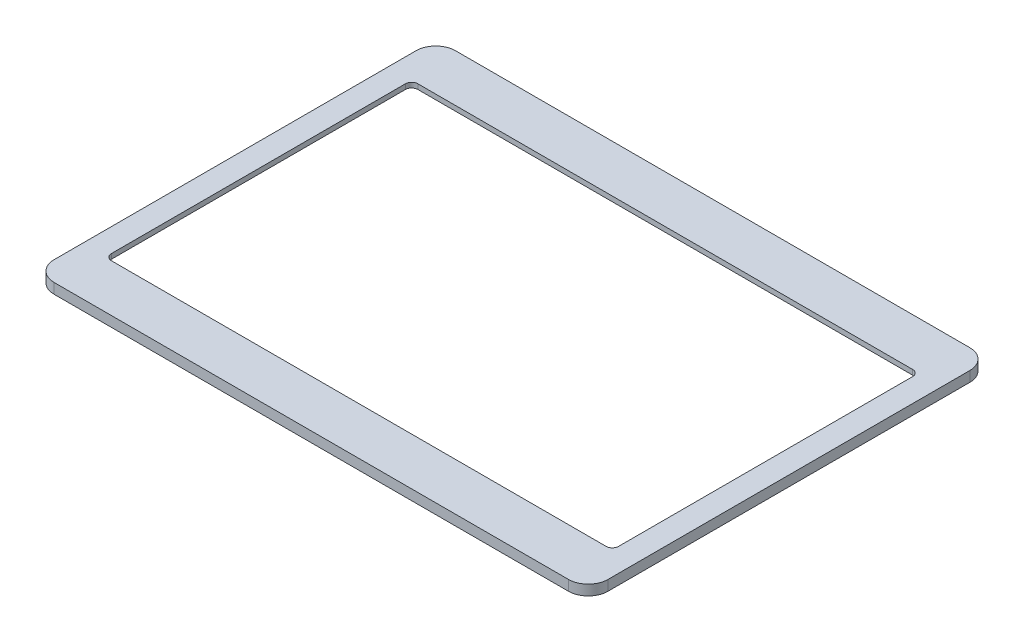
ISO-10303-21;
HEADER;
FILE_DESCRIPTION(('STEP AP214'),'2;1');
FILE_NAME('part.step','',(''),(''),'','','');
FILE_SCHEMA(('AUTOMOTIVE_DESIGN { 1 0 10303 214 1 1 1 1 }'));
ENDSEC;
DATA;
#1=APPLICATION_CONTEXT('core data for automotive mechanical design processes');
#2=APPLICATION_PROTOCOL_DEFINITION('international standard','automotive_design',2000,#1);
#3=PRODUCT_CONTEXT('',#1,'mechanical');
#4=PRODUCT('Part','Part','',(#3));
#5=PRODUCT_RELATED_PRODUCT_CATEGORY('part','',(#4));
#6=PRODUCT_DEFINITION_FORMATION('','',#4);
#7=PRODUCT_DEFINITION_CONTEXT('part definition',#1,'design');
#8=PRODUCT_DEFINITION('design','',#6,#7);
#9=PRODUCT_DEFINITION_SHAPE('','',#8);
#10=(LENGTH_UNIT() NAMED_UNIT(*) SI_UNIT(.MILLI.,.METRE.));
#11=(NAMED_UNIT(*) PLANE_ANGLE_UNIT() SI_UNIT($,.RADIAN.));
#12=(NAMED_UNIT(*) SI_UNIT($,.STERADIAN.) SOLID_ANGLE_UNIT());
#13=UNCERTAINTY_MEASURE_WITH_UNIT(LENGTH_MEASURE(1.E-05),#10,'distance_accuracy_value','');
#14=(GEOMETRIC_REPRESENTATION_CONTEXT(3) GLOBAL_UNCERTAINTY_ASSIGNED_CONTEXT((#13)) GLOBAL_UNIT_ASSIGNED_CONTEXT((#10,
#11,#12)) REPRESENTATION_CONTEXT('',''));
#15=CARTESIAN_POINT('',(0.,0.,0.));
#16=DIRECTION('',(0.,0.,1.));
#17=DIRECTION('',(1.,0.,0.));
#18=AXIS2_PLACEMENT_3D('',#15,#16,#17);
#19=CARTESIAN_POINT('',(-82.65,0.,-58.15));
#20=DIRECTION('',(0.,-1.,0.));
#21=DIRECTION('',(0.,0.,-1.));
#22=AXIS2_PLACEMENT_3D('',#19,#20,#21);
#23=PLANE('',#22);
#24=CARTESIAN_POINT('',(-82.65,0.,-58.15));
#25=DIRECTION('',(0.,1.,0.));
#26=DIRECTION('',(0.,0.,-1.));
#27=AXIS2_PLACEMENT_3D('',#24,#25,#26);
#28=CIRCLE('',#27,6.35);
#29=CARTESIAN_POINT('',(-82.65,0.,-64.5));
#30=VERTEX_POINT('',#29);
#31=CARTESIAN_POINT('',(-89.,0.,-58.15));
#32=VERTEX_POINT('',#31);
#33=EDGE_CURVE('E279',#30,#32,#28,.T.);
#34=ORIENTED_EDGE('',*,*,#33,.F.);
#35=DIRECTION('',(-1.,0.,0.));
#36=VECTOR('',#35,1.);
#37=CARTESIAN_POINT('',(-82.65,0.,-64.5));
#38=LINE('',#37,#36);
#39=CARTESIAN_POINT('',(82.65,0.,-64.5));
#40=VERTEX_POINT('',#39);
#41=EDGE_CURVE('E284',#40,#30,#38,.T.);
#42=ORIENTED_EDGE('',*,*,#41,.F.);
#43=CARTESIAN_POINT('',(82.65,0.,-58.15));
#44=DIRECTION('',(0.,1.,0.));
#45=DIRECTION('',(0.,0.,1.));
#46=AXIS2_PLACEMENT_3D('',#43,#44,#45);
#47=CIRCLE('',#46,6.35);
#48=CARTESIAN_POINT('',(89.,0.,-58.15));
#49=VERTEX_POINT('',#48);
#50=EDGE_CURVE('E311',#49,#40,#47,.T.);
#51=ORIENTED_EDGE('',*,*,#50,.F.);
#52=DIRECTION('',(0.,0.,-1.));
#53=VECTOR('',#52,1.);
#54=CARTESIAN_POINT('',(89.,0.,-58.15));
#55=LINE('',#54,#53);
#56=CARTESIAN_POINT('',(89.0000000000001,0.,58.15));
#57=VERTEX_POINT('',#56);
#58=EDGE_CURVE('E309',#57,#49,#55,.T.);
#59=ORIENTED_EDGE('',*,*,#58,.F.);
#60=CARTESIAN_POINT('',(82.6500000000001,0.,58.15));
#61=DIRECTION('',(0.,1.,0.));
#62=DIRECTION('',(0.,0.,1.));
#63=AXIS2_PLACEMENT_3D('',#60,#61,#62);
#64=CIRCLE('',#63,6.34999999999998);
#65=CARTESIAN_POINT('',(82.6500000000001,0.,64.5));
#66=VERTEX_POINT('',#65);
#67=EDGE_CURVE('E307',#66,#57,#64,.T.);
#68=ORIENTED_EDGE('',*,*,#67,.F.);
#69=DIRECTION('',(1.,0.,0.));
#70=VECTOR('',#69,1.);
#71=CARTESIAN_POINT('',(-82.65,0.,64.5));
#72=LINE('',#71,#70);
#73=CARTESIAN_POINT('',(-82.65,0.,64.5));
#74=VERTEX_POINT('',#73);
#75=EDGE_CURVE('E305',#74,#66,#72,.T.);
#76=ORIENTED_EDGE('',*,*,#75,.F.);
#77=CARTESIAN_POINT('',(-82.65,0.,58.15));
#78=DIRECTION('',(0.,1.,0.));
#79=DIRECTION('',(0.,0.,1.));
#80=AXIS2_PLACEMENT_3D('',#77,#78,#79);
#81=CIRCLE('',#80,6.34999999999999);
#82=CARTESIAN_POINT('',(-88.9999999999999,0.,58.15));
#83=VERTEX_POINT('',#82);
#84=EDGE_CURVE('E303',#83,#74,#81,.T.);
#85=ORIENTED_EDGE('',*,*,#84,.F.);
#86=DIRECTION('',(0.,0.,1.));
#87=VECTOR('',#86,1.);
#88=CARTESIAN_POINT('',(-89.,0.,-58.15));
#89=LINE('',#88,#87);
#90=EDGE_CURVE('E301',#32,#83,#89,.T.);
#91=ORIENTED_EDGE('',*,*,#90,.F.);
#92=EDGE_LOOP('',(#34,#42,#51,#59,#68,#76,#85,#91));
#93=FACE_BOUND('',#92,.T.);
#94=DIRECTION('',(0.,0.,-1.));
#95=VECTOR('',#94,1.);
#96=CARTESIAN_POINT('',(15.5,0.,60.5));
#97=LINE('',#96,#95);
#98=CARTESIAN_POINT('',(15.5,0.,60.5));
#99=VERTEX_POINT('',#98);
#100=CARTESIAN_POINT('',(15.5,0.,58.75));
#101=VERTEX_POINT('',#100);
#102=EDGE_CURVE('E208',#99,#101,#97,.T.);
#103=ORIENTED_EDGE('',*,*,#102,.T.);
#104=DIRECTION('',(1.,0.,0.));
#105=VECTOR('',#104,1.);
#106=CARTESIAN_POINT('',(15.5,0.,58.75));
#107=LINE('',#106,#105);
#108=CARTESIAN_POINT('',(85.5,0.,58.75));
#109=VERTEX_POINT('',#108);
#110=EDGE_CURVE('E47',#101,#109,#107,.T.);
#111=ORIENTED_EDGE('',*,*,#110,.T.);
#112=DIRECTION('',(0.,0.,-1.));
#113=VECTOR('',#112,1.);
#114=CARTESIAN_POINT('',(85.5,0.,-53.5));
#115=LINE('',#114,#113);
#116=CARTESIAN_POINT('',(85.5,0.,-53.5));
#117=VERTEX_POINT('',#116);
#118=EDGE_CURVE('E212',#109,#117,#115,.T.);
#119=ORIENTED_EDGE('',*,*,#118,.T.);
#120=DIRECTION('',(-1.,0.,0.));
#121=VECTOR('',#120,1.);
#122=CARTESIAN_POINT('',(-85.5,0.,-53.5));
#123=LINE('',#122,#121);
#124=CARTESIAN_POINT('',(-85.5,0.,-53.5));
#125=VERTEX_POINT('',#124);
#126=EDGE_CURVE('E663',#117,#125,#123,.T.);
#127=ORIENTED_EDGE('',*,*,#126,.T.);
#128=DIRECTION('',(0.,0.,1.));
#129=VECTOR('',#128,1.);
#130=CARTESIAN_POINT('',(-85.5,0.,-53.5));
#131=LINE('',#130,#129);
#132=CARTESIAN_POINT('',(-85.5,0.,58.5));
#133=VERTEX_POINT('',#132);
#134=EDGE_CURVE('E665',#125,#133,#131,.T.);
#135=ORIENTED_EDGE('',*,*,#134,.T.);
#136=DIRECTION('',(1.,0.,0.));
#137=VECTOR('',#136,1.);
#138=CARTESIAN_POINT('',(-85.5,0.,58.5));
#139=LINE('',#138,#137);
#140=CARTESIAN_POINT('',(-15.5,0.,58.5));
#141=VERTEX_POINT('',#140);
#142=EDGE_CURVE('E647',#133,#141,#139,.T.);
#143=ORIENTED_EDGE('',*,*,#142,.T.);
#144=DIRECTION('',(0.,0.,1.));
#145=VECTOR('',#144,1.);
#146=CARTESIAN_POINT('',(-15.5,0.,58.5));
#147=LINE('',#146,#145);
#148=CARTESIAN_POINT('',(-15.5,0.,60.5));
#149=VERTEX_POINT('',#148);
#150=EDGE_CURVE('E644',#141,#149,#147,.T.);
#151=ORIENTED_EDGE('',*,*,#150,.T.);
#152=DIRECTION('',(1.,0.,0.));
#153=VECTOR('',#152,1.);
#154=CARTESIAN_POINT('',(-15.5,0.,60.5));
#155=LINE('',#154,#153);
#156=EDGE_CURVE('E638',#149,#99,#155,.T.);
#157=ORIENTED_EDGE('',*,*,#156,.T.);
#158=EDGE_LOOP('',(#103,#111,#119,#127,#135,#143,#151,#157));
#159=FACE_BOUND('',#158,.T.);
#160=ADVANCED_FACE('F32',(#93,#159),#23,.T.);
#161=CARTESIAN_POINT('',(-79.5,3.3,-47.25));
#162=DIRECTION('',(0.,-1.,0.));
#163=DIRECTION('',(0.,0.,-1.));
#164=AXIS2_PLACEMENT_3D('',#161,#162,#163);
#165=CYLINDRICAL_SURFACE('',#164,2.);
#166=DIRECTION('',(0.,-1.,0.));
#167=VECTOR('',#166,1.);
#168=CARTESIAN_POINT('',(-81.5,3.3,-47.25));
#169=LINE('',#168,#167);
#170=CARTESIAN_POINT('',(-81.5,3.3,-47.25));
#171=VERTEX_POINT('',#170);
#172=CARTESIAN_POINT('',(-81.5,1.7,-47.25));
#173=VERTEX_POINT('',#172);
#174=EDGE_CURVE('E276',#171,#173,#169,.T.);
#175=ORIENTED_EDGE('',*,*,#174,.T.);
#176=CARTESIAN_POINT('',(-79.5,1.7,-47.25));
#177=DIRECTION('',(0.,-1.,0.));
#178=DIRECTION('',(0.,0.,-1.));
#179=AXIS2_PLACEMENT_3D('',#176,#177,#178);
#180=CIRCLE('',#179,2.);
#181=CARTESIAN_POINT('',(-79.5,1.7,-49.25));
#182=VERTEX_POINT('',#181);
#183=EDGE_CURVE('E235',#173,#182,#180,.T.);
#184=ORIENTED_EDGE('',*,*,#183,.T.);
#185=DIRECTION('',(0.,-1.,0.));
#186=VECTOR('',#185,1.);
#187=CARTESIAN_POINT('',(-79.5,3.3,-49.25));
#188=LINE('',#187,#186);
#189=CARTESIAN_POINT('',(-79.5,3.3,-49.25));
#190=VERTEX_POINT('',#189);
#191=EDGE_CURVE('E255',#190,#182,#188,.T.);
#192=ORIENTED_EDGE('',*,*,#191,.F.);
#193=CARTESIAN_POINT('',(-79.5,3.3,-47.25));
#194=DIRECTION('',(0.,1.,0.));
#195=DIRECTION('',(0.,0.,1.));
#196=AXIS2_PLACEMENT_3D('',#193,#194,#195);
#197=CIRCLE('',#196,2.);
#198=EDGE_CURVE('E238',#190,#171,#197,.T.);
#199=ORIENTED_EDGE('',*,*,#198,.T.);
#200=EDGE_LOOP('',(#175,#184,#192,#199));
#201=FACE_BOUND('',#200,.T.);
#202=ADVANCED_FACE('F385',(#201),#165,.F.);
#203=CARTESIAN_POINT('',(-81.5,3.3,-47.25));
#204=DIRECTION('',(1.,0.,0.));
#205=DIRECTION('',(0.,0.,-1.));
#206=AXIS2_PLACEMENT_3D('',#203,#204,#205);
#207=PLANE('',#206);
#208=DIRECTION('',(0.,-1.,0.));
#209=VECTOR('',#208,1.);
#210=CARTESIAN_POINT('',(-81.5,3.3,47.25));
#211=LINE('',#210,#209);
#212=CARTESIAN_POINT('',(-81.5,3.3,47.25));
#213=VERTEX_POINT('',#212);
#214=CARTESIAN_POINT('',(-81.5,1.7,47.25));
#215=VERTEX_POINT('',#214);
#216=EDGE_CURVE('E273',#213,#215,#211,.T.);
#217=ORIENTED_EDGE('',*,*,#216,.T.);
#218=DIRECTION('',(0.,0.,-1.));
#219=VECTOR('',#218,1.);
#220=CARTESIAN_POINT('',(-81.5,1.7,-47.25));
#221=LINE('',#220,#219);
#222=EDGE_CURVE('E232',#215,#173,#221,.T.);
#223=ORIENTED_EDGE('',*,*,#222,.T.);
#224=ORIENTED_EDGE('',*,*,#174,.F.);
#225=DIRECTION('',(0.,0.,1.));
#226=VECTOR('',#225,1.);
#227=CARTESIAN_POINT('',(-81.5,3.3,-47.25));
#228=LINE('',#227,#226);
#229=EDGE_CURVE('E240',#171,#213,#228,.T.);
#230=ORIENTED_EDGE('',*,*,#229,.T.);
#231=EDGE_LOOP('',(#217,#223,#224,#230));
#232=FACE_BOUND('',#231,.T.);
#233=ADVANCED_FACE('F390',(#232),#207,.T.);
#234=CARTESIAN_POINT('',(-79.5,3.3,47.25));
#235=DIRECTION('',(0.,-1.,0.));
#236=DIRECTION('',(0.,0.,-1.));
#237=AXIS2_PLACEMENT_3D('',#234,#235,#236);
#238=CYLINDRICAL_SURFACE('',#237,2.);
#239=DIRECTION('',(0.,-1.,0.));
#240=VECTOR('',#239,1.);
#241=CARTESIAN_POINT('',(-79.5,3.3,49.25));
#242=LINE('',#241,#240);
#243=CARTESIAN_POINT('',(-79.5,3.3,49.25));
#244=VERTEX_POINT('',#243);
#245=CARTESIAN_POINT('',(-79.5,1.7,49.25));
#246=VERTEX_POINT('',#245);
#247=EDGE_CURVE('E270',#244,#246,#242,.T.);
#248=ORIENTED_EDGE('',*,*,#247,.T.);
#249=CARTESIAN_POINT('',(-79.5,1.7,47.25));
#250=DIRECTION('',(0.,-1.,0.));
#251=DIRECTION('',(0.,0.,-1.));
#252=AXIS2_PLACEMENT_3D('',#249,#250,#251);
#253=CIRCLE('',#252,2.);
#254=EDGE_CURVE('E229',#246,#215,#253,.T.);
#255=ORIENTED_EDGE('',*,*,#254,.T.);
#256=ORIENTED_EDGE('',*,*,#216,.F.);
#257=CARTESIAN_POINT('',(-79.5,3.3,47.25));
#258=DIRECTION('',(0.,1.,0.));
#259=DIRECTION('',(0.,0.,-1.));
#260=AXIS2_PLACEMENT_3D('',#257,#258,#259);
#261=CIRCLE('',#260,2.);
#262=EDGE_CURVE('E242',#213,#244,#261,.T.);
#263=ORIENTED_EDGE('',*,*,#262,.T.);
#264=EDGE_LOOP('',(#248,#255,#256,#263));
#265=FACE_BOUND('',#264,.T.);
#266=ADVANCED_FACE('F508',(#265),#238,.F.);
#267=CARTESIAN_POINT('',(-79.5,3.3,49.25));
#268=DIRECTION('',(0.,0.,-1.));
#269=DIRECTION('',(-1.,0.,0.));
#270=AXIS2_PLACEMENT_3D('',#267,#268,#269);
#271=PLANE('',#270);
#272=DIRECTION('',(0.,-1.,0.));
#273=VECTOR('',#272,1.);
#274=CARTESIAN_POINT('',(79.5,3.3,49.25));
#275=LINE('',#274,#273);
#276=CARTESIAN_POINT('',(79.5,3.3,49.25));
#277=VERTEX_POINT('',#276);
#278=CARTESIAN_POINT('',(79.5,1.7,49.25));
#279=VERTEX_POINT('',#278);
#280=EDGE_CURVE('E267',#277,#279,#275,.T.);
#281=ORIENTED_EDGE('',*,*,#280,.T.);
#282=DIRECTION('',(-1.,0.,0.));
#283=VECTOR('',#282,1.);
#284=CARTESIAN_POINT('',(-79.5,1.7,49.25));
#285=LINE('',#284,#283);
#286=EDGE_CURVE('E226',#279,#246,#285,.T.);
#287=ORIENTED_EDGE('',*,*,#286,.T.);
#288=ORIENTED_EDGE('',*,*,#247,.F.);
#289=DIRECTION('',(1.,0.,0.));
#290=VECTOR('',#289,1.);
#291=CARTESIAN_POINT('',(-79.5,3.3,49.25));
#292=LINE('',#291,#290);
#293=EDGE_CURVE('E244',#244,#277,#292,.T.);
#294=ORIENTED_EDGE('',*,*,#293,.T.);
#295=EDGE_LOOP('',(#281,#287,#288,#294));
#296=FACE_BOUND('',#295,.T.);
#297=ADVANCED_FACE('F517',(#296),#271,.T.);
#298=CARTESIAN_POINT('',(79.5,3.3,47.25));
#299=DIRECTION('',(0.,-1.,0.));
#300=DIRECTION('',(0.,0.,-1.));
#301=AXIS2_PLACEMENT_3D('',#298,#299,#300);
#302=CYLINDRICAL_SURFACE('',#301,2.00000000000001);
#303=DIRECTION('',(0.,-1.,0.));
#304=VECTOR('',#303,1.);
#305=CARTESIAN_POINT('',(81.5,3.3,47.25));
#306=LINE('',#305,#304);
#307=CARTESIAN_POINT('',(81.5,3.3,47.25));
#308=VERTEX_POINT('',#307);
#309=CARTESIAN_POINT('',(81.5,1.7,47.25));
#310=VERTEX_POINT('',#309);
#311=EDGE_CURVE('E264',#308,#310,#306,.T.);
#312=ORIENTED_EDGE('',*,*,#311,.T.);
#313=CARTESIAN_POINT('',(79.5,1.7,47.25));
#314=DIRECTION('',(0.,-1.,0.));
#315=DIRECTION('',(0.,0.,-1.));
#316=AXIS2_PLACEMENT_3D('',#313,#314,#315);
#317=CIRCLE('',#316,2.00000000000001);
#318=EDGE_CURVE('E223',#310,#279,#317,.T.);
#319=ORIENTED_EDGE('',*,*,#318,.T.);
#320=ORIENTED_EDGE('',*,*,#280,.F.);
#321=CARTESIAN_POINT('',(79.5,3.3,47.25));
#322=DIRECTION('',(0.,1.,0.));
#323=DIRECTION('',(0.,0.,1.));
#324=AXIS2_PLACEMENT_3D('',#321,#322,#323);
#325=CIRCLE('',#324,2.00000000000001);
#326=EDGE_CURVE('E246',#277,#308,#325,.T.);
#327=ORIENTED_EDGE('',*,*,#326,.T.);
#328=EDGE_LOOP('',(#312,#319,#320,#327));
#329=FACE_BOUND('',#328,.T.);
#330=ADVANCED_FACE('F526',(#329),#302,.F.);
#331=CARTESIAN_POINT('',(81.5,3.3,-47.25));
#332=DIRECTION('',(-1.,0.,0.));
#333=DIRECTION('',(0.,0.,1.));
#334=AXIS2_PLACEMENT_3D('',#331,#332,#333);
#335=PLANE('',#334);
#336=DIRECTION('',(0.,-1.,0.));
#337=VECTOR('',#336,1.);
#338=CARTESIAN_POINT('',(81.5,3.3,-47.25));
#339=LINE('',#338,#337);
#340=CARTESIAN_POINT('',(81.5,3.3,-47.25));
#341=VERTEX_POINT('',#340);
#342=CARTESIAN_POINT('',(81.5,1.7,-47.25));
#343=VERTEX_POINT('',#342);
#344=EDGE_CURVE('E261',#341,#343,#339,.T.);
#345=ORIENTED_EDGE('',*,*,#344,.T.);
#346=DIRECTION('',(0.,0.,1.));
#347=VECTOR('',#346,1.);
#348=CARTESIAN_POINT('',(81.5,1.7,-47.25));
#349=LINE('',#348,#347);
#350=EDGE_CURVE('E215',#343,#310,#349,.T.);
#351=ORIENTED_EDGE('',*,*,#350,.T.);
#352=ORIENTED_EDGE('',*,*,#311,.F.);
#353=DIRECTION('',(0.,0.,-1.));
#354=VECTOR('',#353,1.);
#355=CARTESIAN_POINT('',(81.5,3.3,-47.25));
#356=LINE('',#355,#354);
#357=EDGE_CURVE('E248',#308,#341,#356,.T.);
#358=ORIENTED_EDGE('',*,*,#357,.T.);
#359=EDGE_LOOP('',(#345,#351,#352,#358));
#360=FACE_BOUND('',#359,.T.);
#361=ADVANCED_FACE('F535',(#360),#335,.T.);
#362=CARTESIAN_POINT('',(79.5,3.3,-47.25));
#363=DIRECTION('',(0.,-1.,0.));
#364=DIRECTION('',(0.,0.,-1.));
#365=AXIS2_PLACEMENT_3D('',#362,#363,#364);
#366=CYLINDRICAL_SURFACE('',#365,2.00000000000001);
#367=DIRECTION('',(0.,-1.,0.));
#368=VECTOR('',#367,1.);
#369=CARTESIAN_POINT('',(79.5,3.3,-49.25));
#370=LINE('',#369,#368);
#371=CARTESIAN_POINT('',(79.5,3.3,-49.25));
#372=VERTEX_POINT('',#371);
#373=CARTESIAN_POINT('',(79.5,1.7,-49.25));
#374=VERTEX_POINT('',#373);
#375=EDGE_CURVE('E258',#372,#374,#370,.T.);
#376=ORIENTED_EDGE('',*,*,#375,.T.);
#377=CARTESIAN_POINT('',(79.5,1.7,-47.25));
#378=DIRECTION('',(0.,-1.,0.));
#379=DIRECTION('',(0.,0.,-1.));
#380=AXIS2_PLACEMENT_3D('',#377,#378,#379);
#381=CIRCLE('',#380,2.00000000000001);
#382=EDGE_CURVE('E55',#374,#343,#381,.T.);
#383=ORIENTED_EDGE('',*,*,#382,.T.);
#384=ORIENTED_EDGE('',*,*,#344,.F.);
#385=CARTESIAN_POINT('',(79.5,3.3,-47.25));
#386=DIRECTION('',(0.,1.,0.));
#387=DIRECTION('',(0.,0.,1.));
#388=AXIS2_PLACEMENT_3D('',#385,#386,#387);
#389=CIRCLE('',#388,2.00000000000001);
#390=EDGE_CURVE('E250',#341,#372,#389,.T.);
#391=ORIENTED_EDGE('',*,*,#390,.T.);
#392=EDGE_LOOP('',(#376,#383,#384,#391));
#393=FACE_BOUND('',#392,.T.);
#394=ADVANCED_FACE('F544',(#393),#366,.F.);
#395=CARTESIAN_POINT('',(-79.5,3.3,-49.25));
#396=DIRECTION('',(0.,0.,1.));
#397=DIRECTION('',(1.,0.,0.));
#398=AXIS2_PLACEMENT_3D('',#395,#396,#397);
#399=PLANE('',#398);
#400=ORIENTED_EDGE('',*,*,#191,.T.);
#401=DIRECTION('',(1.,0.,0.));
#402=VECTOR('',#401,1.);
#403=CARTESIAN_POINT('',(-79.5,1.7,-49.25));
#404=LINE('',#403,#402);
#405=EDGE_CURVE('E11',#182,#374,#404,.T.);
#406=ORIENTED_EDGE('',*,*,#405,.T.);
#407=ORIENTED_EDGE('',*,*,#375,.F.);
#408=DIRECTION('',(-1.,0.,0.));
#409=VECTOR('',#408,1.);
#410=CARTESIAN_POINT('',(-79.5,3.3,-49.25));
#411=LINE('',#410,#409);
#412=EDGE_CURVE('E253',#372,#190,#411,.T.);
#413=ORIENTED_EDGE('',*,*,#412,.T.);
#414=EDGE_LOOP('',(#400,#406,#407,#413));
#415=FACE_BOUND('',#414,.T.);
#416=ADVANCED_FACE('F553',(#415),#399,.T.);
#417=CARTESIAN_POINT('',(-82.65,3.3,-58.15));
#418=DIRECTION('',(0.,-1.,0.));
#419=DIRECTION('',(0.,0.,-1.));
#420=AXIS2_PLACEMENT_3D('',#417,#418,#419);
#421=PLANE('',#420);
#422=CARTESIAN_POINT('',(-82.65,3.3,-58.15));
#423=DIRECTION('',(0.,1.,0.));
#424=DIRECTION('',(0.,0.,-1.));
#425=AXIS2_PLACEMENT_3D('',#422,#423,#424);
#426=CIRCLE('',#425,6.35);
#427=CARTESIAN_POINT('',(-82.65,3.3,-64.5));
#428=VERTEX_POINT('',#427);
#429=CARTESIAN_POINT('',(-89.,3.3,-58.15));
#430=VERTEX_POINT('',#429);
#431=EDGE_CURVE('E280',#428,#430,#426,.T.);
#432=ORIENTED_EDGE('',*,*,#431,.T.);
#433=DIRECTION('',(0.,0.,1.));
#434=VECTOR('',#433,1.);
#435=CARTESIAN_POINT('',(-89.,3.3,-58.15));
#436=LINE('',#435,#434);
#437=CARTESIAN_POINT('',(-88.9999999999999,3.3,58.15));
#438=VERTEX_POINT('',#437);
#439=EDGE_CURVE('E283',#430,#438,#436,.T.);
#440=ORIENTED_EDGE('',*,*,#439,.T.);
#441=CARTESIAN_POINT('',(-82.65,3.3,58.15));
#442=DIRECTION('',(0.,1.,0.));
#443=DIRECTION('',(0.,0.,1.));
#444=AXIS2_PLACEMENT_3D('',#441,#442,#443);
#445=CIRCLE('',#444,6.34999999999999);
#446=CARTESIAN_POINT('',(-82.65,3.3,64.5));
#447=VERTEX_POINT('',#446);
#448=EDGE_CURVE('E286',#438,#447,#445,.T.);
#449=ORIENTED_EDGE('',*,*,#448,.T.);
#450=DIRECTION('',(1.,0.,0.));
#451=VECTOR('',#450,1.);
#452=CARTESIAN_POINT('',(-82.65,3.3,64.5));
#453=LINE('',#452,#451);
#454=CARTESIAN_POINT('',(82.6500000000001,3.3,64.5));
#455=VERTEX_POINT('',#454);
#456=EDGE_CURVE('E288',#447,#455,#453,.T.);
#457=ORIENTED_EDGE('',*,*,#456,.T.);
#458=CARTESIAN_POINT('',(82.6500000000001,3.3,58.15));
#459=DIRECTION('',(0.,1.,0.));
#460=DIRECTION('',(0.,0.,1.));
#461=AXIS2_PLACEMENT_3D('',#458,#459,#460);
#462=CIRCLE('',#461,6.34999999999998);
#463=CARTESIAN_POINT('',(89.0000000000001,3.3,58.15));
#464=VERTEX_POINT('',#463);
#465=EDGE_CURVE('E290',#455,#464,#462,.T.);
#466=ORIENTED_EDGE('',*,*,#465,.T.);
#467=DIRECTION('',(0.,0.,-1.));
#468=VECTOR('',#467,1.);
#469=CARTESIAN_POINT('',(89.,3.3,-58.15));
#470=LINE('',#469,#468);
#471=CARTESIAN_POINT('',(89.,3.3,-58.15));
#472=VERTEX_POINT('',#471);
#473=EDGE_CURVE('E292',#464,#472,#470,.T.);
#474=ORIENTED_EDGE('',*,*,#473,.T.);
#475=CARTESIAN_POINT('',(82.65,3.3,-58.15));
#476=DIRECTION('',(0.,1.,0.));
#477=DIRECTION('',(0.,0.,1.));
#478=AXIS2_PLACEMENT_3D('',#475,#476,#477);
#479=CIRCLE('',#478,6.35);
#480=CARTESIAN_POINT('',(82.65,3.3,-64.5));
#481=VERTEX_POINT('',#480);
#482=EDGE_CURVE('E294',#472,#481,#479,.T.);
#483=ORIENTED_EDGE('',*,*,#482,.T.);
#484=DIRECTION('',(-1.,0.,0.));
#485=VECTOR('',#484,1.);
#486=CARTESIAN_POINT('',(-82.65,3.3,-64.5));
#487=LINE('',#486,#485);
#488=EDGE_CURVE('E296',#481,#428,#487,.T.);
#489=ORIENTED_EDGE('',*,*,#488,.T.);
#490=EDGE_LOOP('',(#432,#440,#449,#457,#466,#474,#483,#489));
#491=FACE_BOUND('',#490,.T.);
#492=ORIENTED_EDGE('',*,*,#198,.F.);
#493=ORIENTED_EDGE('',*,*,#412,.F.);
#494=ORIENTED_EDGE('',*,*,#390,.F.);
#495=ORIENTED_EDGE('',*,*,#357,.F.);
#496=ORIENTED_EDGE('',*,*,#326,.F.);
#497=ORIENTED_EDGE('',*,*,#293,.F.);
#498=ORIENTED_EDGE('',*,*,#262,.F.);
#499=ORIENTED_EDGE('',*,*,#229,.F.);
#500=EDGE_LOOP('',(#492,#493,#494,#495,#496,#497,#498,#499));
#501=FACE_BOUND('',#500,.T.);
#502=ADVANCED_FACE('F359',(#491,#501),#421,.F.);
#503=CARTESIAN_POINT('',(-82.65,3.3,-58.15));
#504=DIRECTION('',(0.,-1.,0.));
#505=DIRECTION('',(0.,0.,-1.));
#506=AXIS2_PLACEMENT_3D('',#503,#504,#505);
#507=CYLINDRICAL_SURFACE('',#506,6.35);
#508=ORIENTED_EDGE('',*,*,#33,.T.);
#509=DIRECTION('',(0.,-1.,0.));
#510=VECTOR('',#509,1.);
#511=CARTESIAN_POINT('',(-89.,3.3,-58.15));
#512=LINE('',#511,#510);
#513=EDGE_CURVE('E40',#430,#32,#512,.T.);
#514=ORIENTED_EDGE('',*,*,#513,.F.);
#515=ORIENTED_EDGE('',*,*,#431,.F.);
#516=DIRECTION('',(0.,-1.,0.));
#517=VECTOR('',#516,1.);
#518=CARTESIAN_POINT('',(-82.65,3.3,-64.5));
#519=LINE('',#518,#517);
#520=EDGE_CURVE('E298',#428,#30,#519,.T.);
#521=ORIENTED_EDGE('',*,*,#520,.T.);
#522=EDGE_LOOP('',(#508,#514,#515,#521));
#523=FACE_BOUND('',#522,.T.);
#524=ADVANCED_FACE('F34',(#523),#507,.T.);
#525=CARTESIAN_POINT('',(-89.,3.3,-58.15));
#526=DIRECTION('',(1.,0.,0.));
#527=DIRECTION('',(0.,0.,-1.));
#528=AXIS2_PLACEMENT_3D('',#525,#526,#527);
#529=PLANE('',#528);
#530=ORIENTED_EDGE('',*,*,#90,.T.);
#531=DIRECTION('',(0.,-1.,0.));
#532=VECTOR('',#531,1.);
#533=CARTESIAN_POINT('',(-88.9999999999999,3.3,58.15));
#534=LINE('',#533,#532);
#535=EDGE_CURVE('E331',#438,#83,#534,.T.);
#536=ORIENTED_EDGE('',*,*,#535,.F.);
#537=ORIENTED_EDGE('',*,*,#439,.F.);
#538=ORIENTED_EDGE('',*,*,#513,.T.);
#539=EDGE_LOOP('',(#530,#536,#537,#538));
#540=FACE_BOUND('',#539,.T.);
#541=ADVANCED_FACE('F336',(#540),#529,.F.);
#542=CARTESIAN_POINT('',(-82.65,3.3,58.15));
#543=DIRECTION('',(0.,-1.,0.));
#544=DIRECTION('',(0.,0.,-1.));
#545=AXIS2_PLACEMENT_3D('',#542,#543,#544);
#546=CYLINDRICAL_SURFACE('',#545,6.34999999999999);
#547=ORIENTED_EDGE('',*,*,#84,.T.);
#548=DIRECTION('',(0.,-1.,0.));
#549=VECTOR('',#548,1.);
#550=CARTESIAN_POINT('',(-82.65,3.3,64.5));
#551=LINE('',#550,#549);
#552=EDGE_CURVE('E328',#447,#74,#551,.T.);
#553=ORIENTED_EDGE('',*,*,#552,.F.);
#554=ORIENTED_EDGE('',*,*,#448,.F.);
#555=ORIENTED_EDGE('',*,*,#535,.T.);
#556=EDGE_LOOP('',(#547,#553,#554,#555));
#557=FACE_BOUND('',#556,.T.);
#558=ADVANCED_FACE('F351',(#557),#546,.T.);
#559=CARTESIAN_POINT('',(-82.65,3.3,64.5));
#560=DIRECTION('',(0.,0.,-1.));
#561=DIRECTION('',(-1.,0.,0.));
#562=AXIS2_PLACEMENT_3D('',#559,#560,#561);
#563=PLANE('',#562);
#564=ORIENTED_EDGE('',*,*,#75,.T.);
#565=DIRECTION('',(0.,-1.,0.));
#566=VECTOR('',#565,1.);
#567=CARTESIAN_POINT('',(82.6500000000001,3.3,64.5));
#568=LINE('',#567,#566);
#569=EDGE_CURVE('E325',#455,#66,#568,.T.);
#570=ORIENTED_EDGE('',*,*,#569,.F.);
#571=ORIENTED_EDGE('',*,*,#456,.F.);
#572=ORIENTED_EDGE('',*,*,#552,.T.);
#573=EDGE_LOOP('',(#564,#570,#571,#572));
#574=FACE_BOUND('',#573,.T.);
#575=ADVANCED_FACE('F355',(#574),#563,.F.);
#576=CARTESIAN_POINT('',(82.6500000000001,3.3,58.15));
#577=DIRECTION('',(0.,-1.,0.));
#578=DIRECTION('',(0.,0.,-1.));
#579=AXIS2_PLACEMENT_3D('',#576,#577,#578);
#580=CYLINDRICAL_SURFACE('',#579,6.34999999999998);
#581=ORIENTED_EDGE('',*,*,#67,.T.);
#582=DIRECTION('',(0.,-1.,0.));
#583=VECTOR('',#582,1.);
#584=CARTESIAN_POINT('',(89.0000000000001,3.3,58.15));
#585=LINE('',#584,#583);
#586=EDGE_CURVE('E322',#464,#57,#585,.T.);
#587=ORIENTED_EDGE('',*,*,#586,.F.);
#588=ORIENTED_EDGE('',*,*,#465,.F.);
#589=ORIENTED_EDGE('',*,*,#569,.T.);
#590=EDGE_LOOP('',(#581,#587,#588,#589));
#591=FACE_BOUND('',#590,.T.);
#592=ADVANCED_FACE('F375',(#591),#580,.T.);
#593=CARTESIAN_POINT('',(89.,3.3,-58.15));
#594=DIRECTION('',(-1.,0.,0.));
#595=DIRECTION('',(0.,0.,1.));
#596=AXIS2_PLACEMENT_3D('',#593,#594,#595);
#597=PLANE('',#596);
#598=ORIENTED_EDGE('',*,*,#58,.T.);
#599=DIRECTION('',(0.,-1.,0.));
#600=VECTOR('',#599,1.);
#601=CARTESIAN_POINT('',(89.,3.3,-58.15));
#602=LINE('',#601,#600);
#603=EDGE_CURVE('E319',#472,#49,#602,.T.);
#604=ORIENTED_EDGE('',*,*,#603,.F.);
#605=ORIENTED_EDGE('',*,*,#473,.F.);
#606=ORIENTED_EDGE('',*,*,#586,.T.);
#607=EDGE_LOOP('',(#598,#604,#605,#606));
#608=FACE_BOUND('',#607,.T.);
#609=ADVANCED_FACE('F372',(#608),#597,.F.);
#610=CARTESIAN_POINT('',(82.65,3.3,-58.15));
#611=DIRECTION('',(0.,-1.,0.));
#612=DIRECTION('',(0.,0.,-1.));
#613=AXIS2_PLACEMENT_3D('',#610,#611,#612);
#614=CYLINDRICAL_SURFACE('',#613,6.35);
#615=ORIENTED_EDGE('',*,*,#50,.T.);
#616=DIRECTION('',(0.,-1.,0.));
#617=VECTOR('',#616,1.);
#618=CARTESIAN_POINT('',(82.65,3.3,-64.5));
#619=LINE('',#618,#617);
#620=EDGE_CURVE('E316',#481,#40,#619,.T.);
#621=ORIENTED_EDGE('',*,*,#620,.F.);
#622=ORIENTED_EDGE('',*,*,#482,.F.);
#623=ORIENTED_EDGE('',*,*,#603,.T.);
#624=EDGE_LOOP('',(#615,#621,#622,#623));
#625=FACE_BOUND('',#624,.T.);
#626=ADVANCED_FACE('F368',(#625),#614,.T.);
#627=CARTESIAN_POINT('',(-82.65,3.3,-64.5));
#628=DIRECTION('',(0.,0.,1.));
#629=DIRECTION('',(1.,0.,0.));
#630=AXIS2_PLACEMENT_3D('',#627,#628,#629);
#631=PLANE('',#630);
#632=ORIENTED_EDGE('',*,*,#41,.T.);
#633=ORIENTED_EDGE('',*,*,#520,.F.);
#634=ORIENTED_EDGE('',*,*,#488,.F.);
#635=ORIENTED_EDGE('',*,*,#620,.T.);
#636=EDGE_LOOP('',(#632,#633,#634,#635));
#637=FACE_BOUND('',#636,.T.);
#638=ADVANCED_FACE('F366',(#637),#631,.F.);
#639=CARTESIAN_POINT('',(15.5,1.7,58.75));
#640=DIRECTION('',(0.,0.,-1.));
#641=DIRECTION('',(-1.,0.,0.));
#642=AXIS2_PLACEMENT_3D('',#639,#640,#641);
#643=PLANE('',#642);
#644=ORIENTED_EDGE('',*,*,#110,.F.);
#645=DIRECTION('',(0.,-1.,0.));
#646=VECTOR('',#645,1.);
#647=CARTESIAN_POINT('',(15.5,1.7,58.75));
#648=LINE('',#647,#646);
#649=CARTESIAN_POINT('',(15.5,1.7,58.75));
#650=VERTEX_POINT('',#649);
#651=EDGE_CURVE('E207',#650,#101,#648,.T.);
#652=ORIENTED_EDGE('',*,*,#651,.F.);
#653=DIRECTION('',(1.,0.,0.));
#654=VECTOR('',#653,1.);
#655=CARTESIAN_POINT('',(15.5,1.7,58.75));
#656=LINE('',#655,#654);
#657=CARTESIAN_POINT('',(85.5,1.7,58.75));
#658=VERTEX_POINT('',#657);
#659=EDGE_CURVE('E198',#650,#658,#656,.T.);
#660=ORIENTED_EDGE('',*,*,#659,.T.);
#661=DIRECTION('',(0.,-1.,0.));
#662=VECTOR('',#661,1.);
#663=CARTESIAN_POINT('',(85.5,1.7,58.75));
#664=LINE('',#663,#662);
#665=EDGE_CURVE('E206',#658,#109,#664,.T.);
#666=ORIENTED_EDGE('',*,*,#665,.T.);
#667=EDGE_LOOP('',(#644,#652,#660,#666));
#668=FACE_BOUND('',#667,.T.);
#669=ADVANCED_FACE('F205',(#668),#643,.T.);
#670=CARTESIAN_POINT('',(85.5,1.7,-53.5));
#671=DIRECTION('',(-1.,0.,0.));
#672=DIRECTION('',(0.,0.,1.));
#673=AXIS2_PLACEMENT_3D('',#670,#671,#672);
#674=PLANE('',#673);
#675=ORIENTED_EDGE('',*,*,#118,.F.);
#676=ORIENTED_EDGE('',*,*,#665,.F.);
#677=DIRECTION('',(0.,0.,-1.));
#678=VECTOR('',#677,1.);
#679=CARTESIAN_POINT('',(85.5,1.7,-53.5));
#680=LINE('',#679,#678);
#681=CARTESIAN_POINT('',(85.5,1.7,-53.5));
#682=VERTEX_POINT('',#681);
#683=EDGE_CURVE('E194',#658,#682,#680,.T.);
#684=ORIENTED_EDGE('',*,*,#683,.T.);
#685=DIRECTION('',(0.,-1.,0.));
#686=VECTOR('',#685,1.);
#687=CARTESIAN_POINT('',(85.5,1.7,-53.5));
#688=LINE('',#687,#686);
#689=EDGE_CURVE('E213',#682,#117,#688,.T.);
#690=ORIENTED_EDGE('',*,*,#689,.T.);
#691=EDGE_LOOP('',(#675,#676,#684,#690));
#692=FACE_BOUND('',#691,.T.);
#693=ADVANCED_FACE('F210',(#692),#674,.T.);
#694=CARTESIAN_POINT('',(-85.5,1.7,-53.5));
#695=DIRECTION('',(0.,0.,1.));
#696=DIRECTION('',(1.,0.,0.));
#697=AXIS2_PLACEMENT_3D('',#694,#695,#696);
#698=PLANE('',#697);
#699=ORIENTED_EDGE('',*,*,#126,.F.);
#700=ORIENTED_EDGE('',*,*,#689,.F.);
#701=DIRECTION('',(-1.,0.,0.));
#702=VECTOR('',#701,1.);
#703=CARTESIAN_POINT('',(-85.5,1.7,-53.5));
#704=LINE('',#703,#702);
#705=CARTESIAN_POINT('',(-85.5,1.7,-53.5));
#706=VERTEX_POINT('',#705);
#707=EDGE_CURVE('E200',#682,#706,#704,.T.);
#708=ORIENTED_EDGE('',*,*,#707,.T.);
#709=DIRECTION('',(0.,-1.,0.));
#710=VECTOR('',#709,1.);
#711=CARTESIAN_POINT('',(-85.5,1.7,-53.5));
#712=LINE('',#711,#710);
#713=EDGE_CURVE('E217',#706,#125,#712,.T.);
#714=ORIENTED_EDGE('',*,*,#713,.T.);
#715=EDGE_LOOP('',(#699,#700,#708,#714));
#716=FACE_BOUND('',#715,.T.);
#717=ADVANCED_FACE('F419',(#716),#698,.T.);
#718=CARTESIAN_POINT('',(-85.5,1.7,-53.5));
#719=DIRECTION('',(1.,0.,0.));
#720=DIRECTION('',(0.,0.,-1.));
#721=AXIS2_PLACEMENT_3D('',#718,#719,#720);
#722=PLANE('',#721);
#723=ORIENTED_EDGE('',*,*,#134,.F.);
#724=ORIENTED_EDGE('',*,*,#713,.F.);
#725=DIRECTION('',(0.,0.,1.));
#726=VECTOR('',#725,1.);
#727=CARTESIAN_POINT('',(-85.5,1.7,-53.5));
#728=LINE('',#727,#726);
#729=CARTESIAN_POINT('',(-85.5,1.7,58.5));
#730=VERTEX_POINT('',#729);
#731=EDGE_CURVE('E684',#706,#730,#728,.T.);
#732=ORIENTED_EDGE('',*,*,#731,.T.);
#733=DIRECTION('',(0.,-1.,0.));
#734=VECTOR('',#733,1.);
#735=CARTESIAN_POINT('',(-85.5,1.7,58.5));
#736=LINE('',#735,#734);
#737=EDGE_CURVE('E658',#730,#133,#736,.T.);
#738=ORIENTED_EDGE('',*,*,#737,.T.);
#739=EDGE_LOOP('',(#723,#724,#732,#738));
#740=FACE_BOUND('',#739,.T.);
#741=ADVANCED_FACE('F426',(#740),#722,.T.);
#742=CARTESIAN_POINT('',(-85.5,1.7,58.5));
#743=DIRECTION('',(0.,0.,-1.));
#744=DIRECTION('',(-1.,0.,0.));
#745=AXIS2_PLACEMENT_3D('',#742,#743,#744);
#746=PLANE('',#745);
#747=ORIENTED_EDGE('',*,*,#142,.F.);
#748=ORIENTED_EDGE('',*,*,#737,.F.);
#749=DIRECTION('',(1.,0.,0.));
#750=VECTOR('',#749,1.);
#751=CARTESIAN_POINT('',(-85.5,1.7,58.5));
#752=LINE('',#751,#750);
#753=CARTESIAN_POINT('',(-15.5,1.7,58.5));
#754=VERTEX_POINT('',#753);
#755=EDGE_CURVE('E674',#730,#754,#752,.T.);
#756=ORIENTED_EDGE('',*,*,#755,.T.);
#757=DIRECTION('',(0.,-1.,0.));
#758=VECTOR('',#757,1.);
#759=CARTESIAN_POINT('',(-15.5,1.7,58.5));
#760=LINE('',#759,#758);
#761=EDGE_CURVE('E656',#754,#141,#760,.T.);
#762=ORIENTED_EDGE('',*,*,#761,.T.);
#763=EDGE_LOOP('',(#747,#748,#756,#762));
#764=FACE_BOUND('',#763,.T.);
#765=ADVANCED_FACE('F434',(#764),#746,.T.);
#766=CARTESIAN_POINT('',(-15.5,1.7,58.5));
#767=DIRECTION('',(1.,0.,0.));
#768=DIRECTION('',(0.,0.,-1.));
#769=AXIS2_PLACEMENT_3D('',#766,#767,#768);
#770=PLANE('',#769);
#771=ORIENTED_EDGE('',*,*,#150,.F.);
#772=ORIENTED_EDGE('',*,*,#761,.F.);
#773=DIRECTION('',(0.,0.,1.));
#774=VECTOR('',#773,1.);
#775=CARTESIAN_POINT('',(-15.5,1.7,58.5));
#776=LINE('',#775,#774);
#777=CARTESIAN_POINT('',(-15.5,1.7,60.5));
#778=VERTEX_POINT('',#777);
#779=EDGE_CURVE('E676',#754,#778,#776,.T.);
#780=ORIENTED_EDGE('',*,*,#779,.T.);
#781=DIRECTION('',(0.,-1.,0.));
#782=VECTOR('',#781,1.);
#783=CARTESIAN_POINT('',(-15.5,1.7,60.5));
#784=LINE('',#783,#782);
#785=EDGE_CURVE('E654',#778,#149,#784,.T.);
#786=ORIENTED_EDGE('',*,*,#785,.T.);
#787=EDGE_LOOP('',(#771,#772,#780,#786));
#788=FACE_BOUND('',#787,.T.);
#789=ADVANCED_FACE('F442',(#788),#770,.T.);
#790=CARTESIAN_POINT('',(-15.5,1.7,60.5));
#791=DIRECTION('',(0.,0.,-1.));
#792=DIRECTION('',(-1.,0.,0.));
#793=AXIS2_PLACEMENT_3D('',#790,#791,#792);
#794=PLANE('',#793);
#795=ORIENTED_EDGE('',*,*,#156,.F.);
#796=ORIENTED_EDGE('',*,*,#785,.F.);
#797=DIRECTION('',(1.,0.,0.));
#798=VECTOR('',#797,1.);
#799=CARTESIAN_POINT('',(-15.5,1.7,60.5));
#800=LINE('',#799,#798);
#801=CARTESIAN_POINT('',(15.5,1.7,60.5));
#802=VERTEX_POINT('',#801);
#803=EDGE_CURVE('E678',#778,#802,#800,.T.);
#804=ORIENTED_EDGE('',*,*,#803,.T.);
#805=DIRECTION('',(0.,-1.,0.));
#806=VECTOR('',#805,1.);
#807=CARTESIAN_POINT('',(15.5,1.7,60.5));
#808=LINE('',#807,#806);
#809=EDGE_CURVE('E637',#802,#99,#808,.T.);
#810=ORIENTED_EDGE('',*,*,#809,.T.);
#811=EDGE_LOOP('',(#795,#796,#804,#810));
#812=FACE_BOUND('',#811,.T.);
#813=ADVANCED_FACE('F450',(#812),#794,.T.);
#814=CARTESIAN_POINT('',(15.5,1.7,60.5));
#815=DIRECTION('',(-1.,0.,0.));
#816=DIRECTION('',(0.,0.,1.));
#817=AXIS2_PLACEMENT_3D('',#814,#815,#816);
#818=PLANE('',#817);
#819=ORIENTED_EDGE('',*,*,#102,.F.);
#820=ORIENTED_EDGE('',*,*,#809,.F.);
#821=DIRECTION('',(0.,0.,-1.));
#822=VECTOR('',#821,1.);
#823=CARTESIAN_POINT('',(15.5,1.7,60.5));
#824=LINE('',#823,#822);
#825=EDGE_CURVE('E652',#802,#650,#824,.T.);
#826=ORIENTED_EDGE('',*,*,#825,.T.);
#827=ORIENTED_EDGE('',*,*,#651,.T.);
#828=EDGE_LOOP('',(#819,#820,#826,#827));
#829=FACE_BOUND('',#828,.T.);
#830=ADVANCED_FACE('F458',(#829),#818,.T.);
#831=CARTESIAN_POINT('',(0.,1.7,0.));
#832=DIRECTION('',(0.,-1.,0.));
#833=DIRECTION('',(0.,0.,-1.));
#834=AXIS2_PLACEMENT_3D('',#831,#832,#833);
#835=PLANE('',#834);
#836=ORIENTED_EDGE('',*,*,#222,.F.);
#837=ORIENTED_EDGE('',*,*,#254,.F.);
#838=ORIENTED_EDGE('',*,*,#286,.F.);
#839=ORIENTED_EDGE('',*,*,#318,.F.);
#840=ORIENTED_EDGE('',*,*,#350,.F.);
#841=ORIENTED_EDGE('',*,*,#382,.F.);
#842=ORIENTED_EDGE('',*,*,#405,.F.);
#843=ORIENTED_EDGE('',*,*,#183,.F.);
#844=EDGE_LOOP('',(#836,#837,#838,#839,#840,#841,#842,#843));
#845=FACE_BOUND('',#844,.T.);
#846=ORIENTED_EDGE('',*,*,#659,.F.);
#847=ORIENTED_EDGE('',*,*,#825,.F.);
#848=ORIENTED_EDGE('',*,*,#803,.F.);
#849=ORIENTED_EDGE('',*,*,#779,.F.);
#850=ORIENTED_EDGE('',*,*,#755,.F.);
#851=ORIENTED_EDGE('',*,*,#731,.F.);
#852=ORIENTED_EDGE('',*,*,#707,.F.);
#853=ORIENTED_EDGE('',*,*,#683,.F.);
#854=EDGE_LOOP('',(#846,#847,#848,#849,#850,#851,#852,#853));
#855=FACE_BOUND('',#854,.T.);
#856=ADVANCED_FACE('F196',(#845,#855),#835,.T.);
#857=CLOSED_SHELL('',(#160,#202,#233,#266,#297,#330,#361,#394,#416,#502,#524,#541,#558,#575,
#592,#609,#626,#638,#669,#693,#717,#741,#765,#789,#813,#830,#856));
#858=MANIFOLD_SOLID_BREP('B2',#857);
#859=ADVANCED_BREP_SHAPE_REPRESENTATION('',(#18,#858),#14);
#860=SHAPE_DEFINITION_REPRESENTATION(#9,#859);
ENDSEC;
END-ISO-10303-21;
